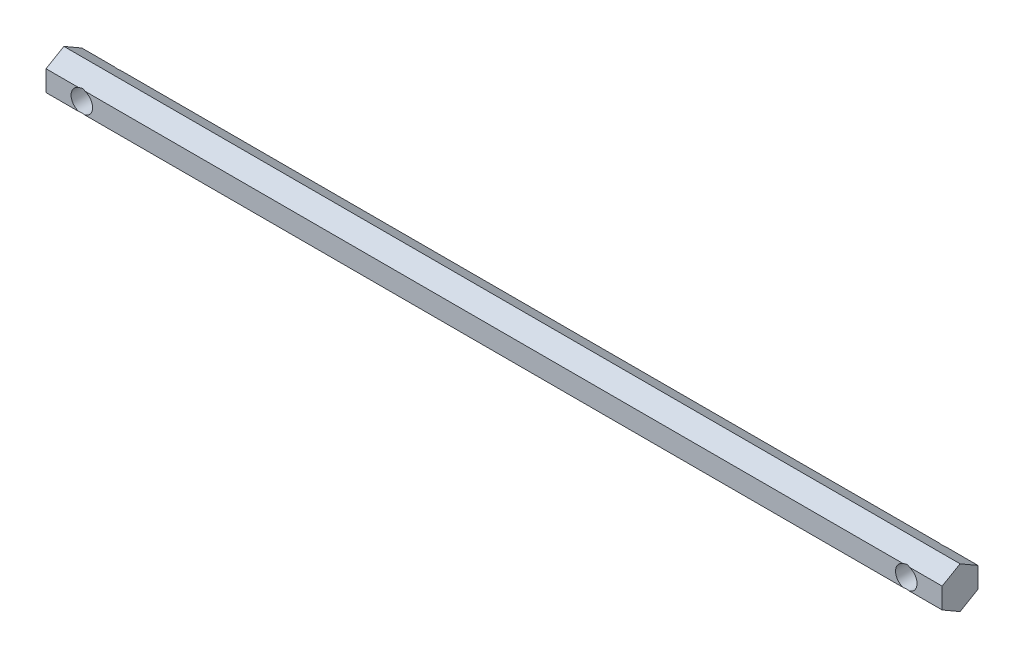
ISO-10303-21;
HEADER;
FILE_DESCRIPTION(('STEP AP214'),'2;1');
FILE_NAME('part.step','',(''),(''),'','','');
FILE_SCHEMA(('AUTOMOTIVE_DESIGN { 1 0 10303 214 1 1 1 1 }'));
ENDSEC;
DATA;
#1=APPLICATION_CONTEXT('core data for automotive mechanical design processes');
#2=APPLICATION_PROTOCOL_DEFINITION('international standard','automotive_design',2000,#1);
#3=PRODUCT_CONTEXT('',#1,'mechanical');
#4=PRODUCT('Part','Part','',(#3));
#5=PRODUCT_RELATED_PRODUCT_CATEGORY('part','',(#4));
#6=PRODUCT_DEFINITION_FORMATION('','',#4);
#7=PRODUCT_DEFINITION_CONTEXT('part definition',#1,'design');
#8=PRODUCT_DEFINITION('design','',#6,#7);
#9=PRODUCT_DEFINITION_SHAPE('','',#8);
#10=(LENGTH_UNIT() NAMED_UNIT(*) SI_UNIT(.MILLI.,.METRE.));
#11=(NAMED_UNIT(*) PLANE_ANGLE_UNIT() SI_UNIT($,.RADIAN.));
#12=(NAMED_UNIT(*) SI_UNIT($,.STERADIAN.) SOLID_ANGLE_UNIT());
#13=UNCERTAINTY_MEASURE_WITH_UNIT(LENGTH_MEASURE(1.E-05),#10,'distance_accuracy_value','');
#14=(GEOMETRIC_REPRESENTATION_CONTEXT(3) GLOBAL_UNCERTAINTY_ASSIGNED_CONTEXT((#13)) GLOBAL_UNIT_ASSIGNED_CONTEXT((#10,
#11,#12)) REPRESENTATION_CONTEXT('',''));
#15=CARTESIAN_POINT('',(0.,0.,0.));
#16=DIRECTION('',(0.,0.,1.));
#17=DIRECTION('',(1.,0.,0.));
#18=AXIS2_PLACEMENT_3D('',#15,#16,#17);
#19=CARTESIAN_POINT('',(125.,2.88675134594811,5.));
#20=DIRECTION('',(0.,0.,-1.));
#21=DIRECTION('',(0.,1.,0.));
#22=AXIS2_PLACEMENT_3D('',#19,#20,#21);
#23=PLANE('',#22);
#24=DIRECTION('',(-1.,0.,0.));
#25=VECTOR('',#24,1.);
#26=CARTESIAN_POINT('',(125.,2.88675134594811,5.));
#27=LINE('',#26,#25);
#28=CARTESIAN_POINT('',(114.183503419072,2.88675134594811,5.));
#29=VERTEX_POINT('',#28);
#30=CARTESIAN_POINT('',(-114.183503419072,2.88675134594811,5.));
#31=VERTEX_POINT('',#30);
#32=EDGE_CURVE('E263',#29,#31,#27,.T.);
#33=ORIENTED_EDGE('',*,*,#32,.T.);
#34=CARTESIAN_POINT('',(-115.,0.,5.));
#35=DIRECTION('',(0.,0.,1.));
#36=DIRECTION('',(1.,0.,0.));
#37=AXIS2_PLACEMENT_3D('',#34,#35,#36);
#38=CIRCLE('',#37,3.00000000000001);
#39=CARTESIAN_POINT('',(-114.183503419072,-2.88675134594814,5.));
#40=VERTEX_POINT('',#39);
#41=EDGE_CURVE('E320',#40,#31,#38,.T.);
#42=ORIENTED_EDGE('',*,*,#41,.F.);
#43=DIRECTION('',(-1.,0.,0.));
#44=VECTOR('',#43,1.);
#45=CARTESIAN_POINT('',(125.,-2.88675134594815,4.99999999999998));
#46=LINE('',#45,#44);
#47=CARTESIAN_POINT('',(114.183503419072,-2.88675134594815,4.99999999999998));
#48=VERTEX_POINT('',#47);
#49=EDGE_CURVE('E257',#48,#40,#46,.T.);
#50=ORIENTED_EDGE('',*,*,#49,.F.);
#51=CARTESIAN_POINT('',(115.,0.,5.));
#52=DIRECTION('',(0.,0.,1.));
#53=DIRECTION('',(1.,0.,0.));
#54=AXIS2_PLACEMENT_3D('',#51,#52,#53);
#55=CIRCLE('',#54,3.00000000000001);
#56=EDGE_CURVE('E63',#29,#48,#55,.T.);
#57=ORIENTED_EDGE('',*,*,#56,.F.);
#58=EDGE_LOOP('',(#33,#42,#50,#57));
#59=FACE_BOUND('',#58,.T.);
#60=ADVANCED_FACE('F39',(#59),#23,.F.);
#61=CARTESIAN_POINT('',(125.,2.88675134594811,5.));
#62=VERTEX_POINT('',#61);
#63=CARTESIAN_POINT('',(115.816496580928,2.88675134594811,5.));
#64=VERTEX_POINT('',#63);
#65=EDGE_CURVE('E258',#62,#64,#27,.T.);
#66=ORIENTED_EDGE('',*,*,#65,.T.);
#67=CARTESIAN_POINT('',(115.816496580928,-2.88675134594814,5.));
#68=VERTEX_POINT('',#67);
#69=EDGE_CURVE('E325',#68,#64,#55,.T.);
#70=ORIENTED_EDGE('',*,*,#69,.F.);
#71=CARTESIAN_POINT('',(125.,-2.88675134594815,4.99999999999998));
#72=VERTEX_POINT('',#71);
#73=EDGE_CURVE('E253',#72,#68,#46,.T.);
#74=ORIENTED_EDGE('',*,*,#73,.F.);
#75=DIRECTION('',(0.,-1.,0.));
#76=VECTOR('',#75,1.);
#77=CARTESIAN_POINT('',(125.,2.88675134594811,5.));
#78=LINE('',#77,#76);
#79=EDGE_CURVE('E220',#62,#72,#78,.T.);
#80=ORIENTED_EDGE('',*,*,#79,.F.);
#81=EDGE_LOOP('',(#66,#70,#74,#80));
#82=FACE_BOUND('',#81,.T.);
#83=ADVANCED_FACE('F297',(#82),#23,.F.);
#84=CARTESIAN_POINT('',(125.,-2.88675134594808,-5.00000000000002));
#85=DIRECTION('',(0.,0.,1.));
#86=DIRECTION('',(0.,-1.,0.));
#87=AXIS2_PLACEMENT_3D('',#84,#85,#86);
#88=PLANE('',#87);
#89=DIRECTION('',(-1.,0.,0.));
#90=VECTOR('',#89,1.);
#91=CARTESIAN_POINT('',(125.,-2.88675134594808,-5.00000000000002));
#92=LINE('',#91,#90);
#93=CARTESIAN_POINT('',(114.183503419072,-2.88675134594808,-5.00000000000002));
#94=VERTEX_POINT('',#93);
#95=CARTESIAN_POINT('',(-114.183503419072,-2.88675134594808,-5.00000000000002));
#96=VERTEX_POINT('',#95);
#97=EDGE_CURVE('E175',#94,#96,#92,.T.);
#98=ORIENTED_EDGE('',*,*,#97,.T.);
#99=CARTESIAN_POINT('',(-115.,0.,-4.99999999999999));
#100=DIRECTION('',(0.,0.,1.));
#101=DIRECTION('',(0.,-1.,0.));
#102=AXIS2_PLACEMENT_3D('',#99,#100,#101);
#103=CIRCLE('',#102,3.00000000000001);
#104=CARTESIAN_POINT('',(-114.183503419072,2.88675134594818,-5.00000000000002));
#105=VERTEX_POINT('',#104);
#106=EDGE_CURVE('E11',#96,#105,#103,.T.);
#107=ORIENTED_EDGE('',*,*,#106,.T.);
#108=DIRECTION('',(-1.,0.,0.));
#109=VECTOR('',#108,1.);
#110=CARTESIAN_POINT('',(125.,2.88675134594818,-4.99999999999996));
#111=LINE('',#110,#109);
#112=CARTESIAN_POINT('',(114.183503419072,2.88675134594818,-5.00000000000002));
#113=VERTEX_POINT('',#112);
#114=EDGE_CURVE('E170',#113,#105,#111,.T.);
#115=ORIENTED_EDGE('',*,*,#114,.F.);
#116=CARTESIAN_POINT('',(115.,0.,-4.99999999999999));
#117=DIRECTION('',(0.,0.,1.));
#118=DIRECTION('',(0.,-1.,0.));
#119=AXIS2_PLACEMENT_3D('',#116,#117,#118);
#120=CIRCLE('',#119,3.00000000000001);
#121=EDGE_CURVE('E146',#113,#94,#120,.T.);
#122=ORIENTED_EDGE('',*,*,#121,.T.);
#123=EDGE_LOOP('',(#98,#107,#115,#122));
#124=FACE_BOUND('',#123,.T.);
#125=ADVANCED_FACE('F268',(#124),#88,.F.);
#126=CARTESIAN_POINT('',(125.,-2.88675134594808,-5.00000000000002));
#127=VERTEX_POINT('',#126);
#128=CARTESIAN_POINT('',(115.816496580928,-2.88675134594808,-5.00000000000002));
#129=VERTEX_POINT('',#128);
#130=EDGE_CURVE('E163',#127,#129,#92,.T.);
#131=ORIENTED_EDGE('',*,*,#130,.T.);
#132=CARTESIAN_POINT('',(115.816496580928,2.88675134594818,-5.00000000000002));
#133=VERTEX_POINT('',#132);
#134=EDGE_CURVE('E143',#129,#133,#120,.T.);
#135=ORIENTED_EDGE('',*,*,#134,.T.);
#136=CARTESIAN_POINT('',(125.,2.88675134594818,-4.99999999999996));
#137=VERTEX_POINT('',#136);
#138=EDGE_CURVE('E160',#137,#133,#111,.T.);
#139=ORIENTED_EDGE('',*,*,#138,.F.);
#140=DIRECTION('',(0.,1.,0.));
#141=VECTOR('',#140,1.);
#142=CARTESIAN_POINT('',(125.,-2.88675134594808,-5.00000000000002));
#143=LINE('',#142,#141);
#144=EDGE_CURVE('E179',#127,#137,#143,.T.);
#145=ORIENTED_EDGE('',*,*,#144,.F.);
#146=EDGE_LOOP('',(#131,#135,#139,#145));
#147=FACE_BOUND('',#146,.T.);
#148=ADVANCED_FACE('F158',(#147),#88,.F.);
#149=CARTESIAN_POINT('',(125.,2.88675134594818,-4.99999999999996));
#150=DIRECTION('',(0.,-0.866025403784442,0.499999999999995));
#151=DIRECTION('',(0.,-0.499999999999995,-0.866025403784441));
#152=AXIS2_PLACEMENT_3D('',#149,#150,#151);
#153=PLANE('',#152);
#154=ORIENTED_EDGE('',*,*,#114,.T.);
#155=CARTESIAN_POINT('',(-115.,0.,-10.0000000000001));
#156=DIRECTION('',(0.,-0.866025403784442,0.499999999999995));
#157=DIRECTION('',(0.,0.499999999999995,0.866025403784441));
#158=AXIS2_PLACEMENT_3D('',#155,#156,#157);
#159=ELLIPSE('',#158,6.00000000000008,3.00000000000001);
#160=CARTESIAN_POINT('',(-115.816496580928,2.88675134594818,-5.00000000000002));
#161=VERTEX_POINT('',#160);
#162=EDGE_CURVE('E197',#105,#161,#159,.T.);
#163=ORIENTED_EDGE('',*,*,#162,.T.);
#164=CARTESIAN_POINT('',(-125.,2.88675134594818,-4.99999999999996));
#165=VERTEX_POINT('',#164);
#166=EDGE_CURVE('E172',#161,#165,#111,.T.);
#167=ORIENTED_EDGE('',*,*,#166,.T.);
#168=DIRECTION('',(0.,0.499999999999995,0.866025403784441));
#169=VECTOR('',#168,1.);
#170=CARTESIAN_POINT('',(-125.,2.88675134594818,-4.99999999999996));
#171=LINE('',#170,#169);
#172=CARTESIAN_POINT('',(-125.,5.77350269189625,0.));
#173=VERTEX_POINT('',#172);
#174=EDGE_CURVE('E193',#165,#173,#171,.T.);
#175=ORIENTED_EDGE('',*,*,#174,.T.);
#176=DIRECTION('',(-1.,0.,0.));
#177=VECTOR('',#176,1.);
#178=CARTESIAN_POINT('',(125.,5.77350269189625,0.));
#179=LINE('',#178,#177);
#180=CARTESIAN_POINT('',(125.,5.77350269189625,0.));
#181=VERTEX_POINT('',#180);
#182=EDGE_CURVE('E262',#181,#173,#179,.T.);
#183=ORIENTED_EDGE('',*,*,#182,.F.);
#184=DIRECTION('',(0.,0.499999999999995,0.866025403784441));
#185=VECTOR('',#184,1.);
#186=CARTESIAN_POINT('',(125.,2.88675134594818,-4.99999999999996));
#187=LINE('',#186,#185);
#188=EDGE_CURVE('E167',#137,#181,#187,.T.);
#189=ORIENTED_EDGE('',*,*,#188,.F.);
#190=ORIENTED_EDGE('',*,*,#138,.T.);
#191=CARTESIAN_POINT('',(115.,0.,-10.0000000000001));
#192=DIRECTION('',(0.,-0.866025403784442,0.499999999999995));
#193=DIRECTION('',(0.,0.499999999999995,0.866025403784441));
#194=AXIS2_PLACEMENT_3D('',#191,#192,#193);
#195=ELLIPSE('',#194,6.00000000000008,3.00000000000001);
#196=EDGE_CURVE('E140',#133,#113,#195,.T.);
#197=ORIENTED_EDGE('',*,*,#196,.T.);
#198=EDGE_LOOP('',(#154,#163,#167,#175,#183,#189,#190,#197));
#199=FACE_BOUND('',#198,.T.);
#200=ADVANCED_FACE('F41',(#199),#153,.F.);
#201=CARTESIAN_POINT('',(125.,5.77350269189625,0.));
#202=DIRECTION('',(0.,-0.866025403784438,-0.500000000000001));
#203=DIRECTION('',(0.,0.500000000000001,-0.866025403784438));
#204=AXIS2_PLACEMENT_3D('',#201,#202,#203);
#205=PLANE('',#204);
#206=CARTESIAN_POINT('',(-115.816496580928,2.88675134594811,5.));
#207=VERTEX_POINT('',#206);
#208=CARTESIAN_POINT('',(-125.,2.88675134594811,5.));
#209=VERTEX_POINT('',#208);
#210=EDGE_CURVE('E256',#207,#209,#27,.T.);
#211=ORIENTED_EDGE('',*,*,#210,.F.);
#212=CARTESIAN_POINT('',(-115.,0.,9.99999999999996));
#213=DIRECTION('',(0.,-0.866025403784438,-0.500000000000001));
#214=DIRECTION('',(0.,-0.500000000000001,0.866025403784438));
#215=AXIS2_PLACEMENT_3D('',#212,#213,#214);
#216=ELLIPSE('',#215,6.,3.00000000000001);
#217=EDGE_CURVE('E276',#207,#31,#216,.T.);
#218=ORIENTED_EDGE('',*,*,#217,.T.);
#219=ORIENTED_EDGE('',*,*,#32,.F.);
#220=CARTESIAN_POINT('',(115.,0.,9.99999999999996));
#221=DIRECTION('',(0.,-0.866025403784438,-0.500000000000001));
#222=DIRECTION('',(0.,-0.500000000000001,0.866025403784438));
#223=AXIS2_PLACEMENT_3D('',#220,#221,#222);
#224=ELLIPSE('',#223,6.,3.00000000000001);
#225=EDGE_CURVE('E153',#29,#64,#224,.T.);
#226=ORIENTED_EDGE('',*,*,#225,.T.);
#227=ORIENTED_EDGE('',*,*,#65,.F.);
#228=DIRECTION('',(0.,-0.500000000000001,0.866025403784438));
#229=VECTOR('',#228,1.);
#230=CARTESIAN_POINT('',(125.,5.77350269189625,0.));
#231=LINE('',#230,#229);
#232=EDGE_CURVE('E217',#181,#62,#231,.T.);
#233=ORIENTED_EDGE('',*,*,#232,.F.);
#234=ORIENTED_EDGE('',*,*,#182,.T.);
#235=DIRECTION('',(0.,-0.500000000000001,0.866025403784438));
#236=VECTOR('',#235,1.);
#237=CARTESIAN_POINT('',(-125.,5.77350269189625,0.));
#238=LINE('',#237,#236);
#239=EDGE_CURVE('E196',#173,#209,#238,.T.);
#240=ORIENTED_EDGE('',*,*,#239,.T.);
#241=EDGE_LOOP('',(#211,#218,#219,#226,#227,#233,#234,#240));
#242=FACE_BOUND('',#241,.T.);
#243=ADVANCED_FACE('F307',(#242),#205,.F.);
#244=CARTESIAN_POINT('',(-115.816496580928,-2.88675134594815,4.99999999999998));
#245=VERTEX_POINT('',#244);
#246=CARTESIAN_POINT('',(-125.,-2.88675134594815,4.99999999999998));
#247=VERTEX_POINT('',#246);
#248=EDGE_CURVE('E243',#245,#247,#46,.T.);
#249=ORIENTED_EDGE('',*,*,#248,.F.);
#250=EDGE_CURVE('E55',#207,#245,#38,.T.);
#251=ORIENTED_EDGE('',*,*,#250,.F.);
#252=ORIENTED_EDGE('',*,*,#210,.T.);
#253=DIRECTION('',(0.,-1.,0.));
#254=VECTOR('',#253,1.);
#255=CARTESIAN_POINT('',(-125.,2.88675134594811,5.));
#256=LINE('',#255,#254);
#257=EDGE_CURVE('E201',#209,#247,#256,.T.);
#258=ORIENTED_EDGE('',*,*,#257,.T.);
#259=EDGE_LOOP('',(#249,#251,#252,#258));
#260=FACE_BOUND('',#259,.T.);
#261=ADVANCED_FACE('F300',(#260),#23,.F.);
#262=CARTESIAN_POINT('',(125.,-2.88675134594815,4.99999999999998));
#263=DIRECTION('',(0.,0.866025403784442,-0.499999999999995));
#264=DIRECTION('',(0.,0.499999999999995,0.866025403784441));
#265=AXIS2_PLACEMENT_3D('',#262,#263,#264);
#266=PLANE('',#265);
#267=ORIENTED_EDGE('',*,*,#49,.T.);
#268=CARTESIAN_POINT('',(-115.,0.,10.0000000000001));
#269=DIRECTION('',(0.,0.866025403784442,-0.499999999999995));
#270=DIRECTION('',(0.,0.499999999999995,0.866025403784441));
#271=AXIS2_PLACEMENT_3D('',#268,#269,#270);
#272=ELLIPSE('',#271,6.00000000000007,3.00000000000001);
#273=EDGE_CURVE('E273',#40,#245,#272,.T.);
#274=ORIENTED_EDGE('',*,*,#273,.T.);
#275=ORIENTED_EDGE('',*,*,#248,.T.);
#276=DIRECTION('',(0.,-0.499999999999995,-0.866025403784441));
#277=VECTOR('',#276,1.);
#278=CARTESIAN_POINT('',(-125.,-2.88675134594815,4.99999999999998));
#279=LINE('',#278,#277);
#280=CARTESIAN_POINT('',(-125.,-5.77350269189625,0.));
#281=VERTEX_POINT('',#280);
#282=EDGE_CURVE('E205',#247,#281,#279,.T.);
#283=ORIENTED_EDGE('',*,*,#282,.T.);
#284=DIRECTION('',(-1.,0.,0.));
#285=VECTOR('',#284,1.);
#286=CARTESIAN_POINT('',(125.,-5.77350269189625,0.));
#287=LINE('',#286,#285);
#288=CARTESIAN_POINT('',(125.,-5.77350269189625,0.));
#289=VERTEX_POINT('',#288);
#290=EDGE_CURVE('E236',#289,#281,#287,.T.);
#291=ORIENTED_EDGE('',*,*,#290,.F.);
#292=DIRECTION('',(0.,-0.499999999999995,-0.866025403784441));
#293=VECTOR('',#292,1.);
#294=CARTESIAN_POINT('',(125.,-2.88675134594815,4.99999999999998));
#295=LINE('',#294,#293);
#296=EDGE_CURVE('E189',#72,#289,#295,.T.);
#297=ORIENTED_EDGE('',*,*,#296,.F.);
#298=ORIENTED_EDGE('',*,*,#73,.T.);
#299=CARTESIAN_POINT('',(115.,0.,10.0000000000001));
#300=DIRECTION('',(0.,0.866025403784442,-0.499999999999995));
#301=DIRECTION('',(0.,0.499999999999995,0.866025403784441));
#302=AXIS2_PLACEMENT_3D('',#299,#300,#301);
#303=ELLIPSE('',#302,6.00000000000007,3.00000000000001);
#304=EDGE_CURVE('E318',#68,#48,#303,.T.);
#305=ORIENTED_EDGE('',*,*,#304,.T.);
#306=EDGE_LOOP('',(#267,#274,#275,#283,#291,#297,#298,#305));
#307=FACE_BOUND('',#306,.T.);
#308=ADVANCED_FACE('F238',(#307),#266,.F.);
#309=CARTESIAN_POINT('',(125.,-5.77350269189625,0.));
#310=DIRECTION('',(0.,0.866025403784435,0.500000000000007));
#311=DIRECTION('',(0.,-0.500000000000007,0.866025403784435));
#312=AXIS2_PLACEMENT_3D('',#309,#310,#311);
#313=PLANE('',#312);
#314=CARTESIAN_POINT('',(-115.816496580928,-2.88675134594808,-5.00000000000002));
#315=VERTEX_POINT('',#314);
#316=CARTESIAN_POINT('',(-125.,-2.88675134594808,-5.00000000000002));
#317=VERTEX_POINT('',#316);
#318=EDGE_CURVE('E169',#315,#317,#92,.T.);
#319=ORIENTED_EDGE('',*,*,#318,.F.);
#320=CARTESIAN_POINT('',(-115.,0.,-9.99999999999983));
#321=DIRECTION('',(0.,0.866025403784435,0.500000000000007));
#322=DIRECTION('',(0.,-0.500000000000007,0.866025403784435));
#323=AXIS2_PLACEMENT_3D('',#320,#321,#322);
#324=ELLIPSE('',#323,5.99999999999993,3.00000000000001);
#325=EDGE_CURVE('E152',#315,#96,#324,.T.);
#326=ORIENTED_EDGE('',*,*,#325,.T.);
#327=ORIENTED_EDGE('',*,*,#97,.F.);
#328=CARTESIAN_POINT('',(115.,0.,-9.99999999999983));
#329=DIRECTION('',(0.,0.866025403784435,0.500000000000007));
#330=DIRECTION('',(0.,-0.500000000000007,0.866025403784435));
#331=AXIS2_PLACEMENT_3D('',#328,#329,#330);
#332=ELLIPSE('',#331,5.99999999999993,3.00000000000001);
#333=EDGE_CURVE('E248',#94,#129,#332,.T.);
#334=ORIENTED_EDGE('',*,*,#333,.T.);
#335=ORIENTED_EDGE('',*,*,#130,.F.);
#336=DIRECTION('',(0.,0.500000000000007,-0.866025403784435));
#337=VECTOR('',#336,1.);
#338=CARTESIAN_POINT('',(125.,-5.77350269189625,0.));
#339=LINE('',#338,#337);
#340=EDGE_CURVE('E185',#289,#127,#339,.T.);
#341=ORIENTED_EDGE('',*,*,#340,.F.);
#342=ORIENTED_EDGE('',*,*,#290,.T.);
#343=DIRECTION('',(0.,0.500000000000007,-0.866025403784435));
#344=VECTOR('',#343,1.);
#345=CARTESIAN_POINT('',(-125.,-5.77350269189625,0.));
#346=LINE('',#345,#344);
#347=EDGE_CURVE('E208',#281,#317,#346,.T.);
#348=ORIENTED_EDGE('',*,*,#347,.T.);
#349=EDGE_LOOP('',(#319,#326,#327,#334,#335,#341,#342,#348));
#350=FACE_BOUND('',#349,.T.);
#351=ADVANCED_FACE('F246',(#350),#313,.F.);
#352=ORIENTED_EDGE('',*,*,#166,.F.);
#353=EDGE_CURVE('E43',#161,#315,#103,.T.);
#354=ORIENTED_EDGE('',*,*,#353,.T.);
#355=ORIENTED_EDGE('',*,*,#318,.T.);
#356=DIRECTION('',(0.,1.,0.));
#357=VECTOR('',#356,1.);
#358=CARTESIAN_POINT('',(-125.,-2.88675134594808,-5.00000000000002));
#359=LINE('',#358,#357);
#360=EDGE_CURVE('E211',#317,#165,#359,.T.);
#361=ORIENTED_EDGE('',*,*,#360,.T.);
#362=EDGE_LOOP('',(#352,#354,#355,#361));
#363=FACE_BOUND('',#362,.T.);
#364=ADVANCED_FACE('F286',(#363),#88,.F.);
#365=CARTESIAN_POINT('',(125.,0.,0.));
#366=DIRECTION('',(1.,0.,0.));
#367=DIRECTION('',(0.,0.,-1.));
#368=AXIS2_PLACEMENT_3D('',#365,#366,#367);
#369=PLANE('',#368);
#370=ORIENTED_EDGE('',*,*,#188,.T.);
#371=ORIENTED_EDGE('',*,*,#232,.T.);
#372=ORIENTED_EDGE('',*,*,#79,.T.);
#373=ORIENTED_EDGE('',*,*,#296,.T.);
#374=ORIENTED_EDGE('',*,*,#340,.T.);
#375=ORIENTED_EDGE('',*,*,#144,.T.);
#376=EDGE_LOOP('',(#370,#371,#372,#373,#374,#375));
#377=FACE_BOUND('',#376,.T.);
#378=ADVANCED_FACE('F229',(#377),#369,.T.);
#379=CARTESIAN_POINT('',(-125.,0.,0.));
#380=DIRECTION('',(1.,0.,0.));
#381=DIRECTION('',(0.,0.,-1.));
#382=AXIS2_PLACEMENT_3D('',#379,#380,#381);
#383=PLANE('',#382);
#384=ORIENTED_EDGE('',*,*,#174,.F.);
#385=ORIENTED_EDGE('',*,*,#360,.F.);
#386=ORIENTED_EDGE('',*,*,#347,.F.);
#387=ORIENTED_EDGE('',*,*,#282,.F.);
#388=ORIENTED_EDGE('',*,*,#257,.F.);
#389=ORIENTED_EDGE('',*,*,#239,.F.);
#390=EDGE_LOOP('',(#384,#385,#386,#387,#388,#389));
#391=FACE_BOUND('',#390,.T.);
#392=ADVANCED_FACE('F294',(#391),#383,.F.);
#393=CARTESIAN_POINT('',(115.,0.,-5.00000000000002));
#394=DIRECTION('',(0.,0.,1.));
#395=DIRECTION('',(1.,0.,0.));
#396=AXIS2_PLACEMENT_3D('',#393,#394,#395);
#397=CYLINDRICAL_SURFACE('',#396,3.00000000000001);
#398=ORIENTED_EDGE('',*,*,#56,.T.);
#399=ORIENTED_EDGE('',*,*,#304,.F.);
#400=ORIENTED_EDGE('',*,*,#69,.T.);
#401=ORIENTED_EDGE('',*,*,#225,.F.);
#402=EDGE_LOOP('',(#398,#399,#400,#401));
#403=FACE_BOUND('',#402,.T.);
#404=ORIENTED_EDGE('',*,*,#134,.F.);
#405=ORIENTED_EDGE('',*,*,#333,.F.);
#406=ORIENTED_EDGE('',*,*,#121,.F.);
#407=ORIENTED_EDGE('',*,*,#196,.F.);
#408=EDGE_LOOP('',(#404,#405,#406,#407));
#409=FACE_BOUND('',#408,.T.);
#410=ADVANCED_FACE('F142',(#403,#409),#397,.F.);
#411=CARTESIAN_POINT('',(-115.,0.,-5.00000000000002));
#412=DIRECTION('',(0.,0.,1.));
#413=DIRECTION('',(1.,0.,0.));
#414=AXIS2_PLACEMENT_3D('',#411,#412,#413);
#415=CYLINDRICAL_SURFACE('',#414,3.00000000000001);
#416=ORIENTED_EDGE('',*,*,#250,.T.);
#417=ORIENTED_EDGE('',*,*,#273,.F.);
#418=ORIENTED_EDGE('',*,*,#41,.T.);
#419=ORIENTED_EDGE('',*,*,#217,.F.);
#420=EDGE_LOOP('',(#416,#417,#418,#419));
#421=FACE_BOUND('',#420,.T.);
#422=ORIENTED_EDGE('',*,*,#106,.F.);
#423=ORIENTED_EDGE('',*,*,#325,.F.);
#424=ORIENTED_EDGE('',*,*,#353,.F.);
#425=ORIENTED_EDGE('',*,*,#162,.F.);
#426=EDGE_LOOP('',(#422,#423,#424,#425));
#427=FACE_BOUND('',#426,.T.);
#428=ADVANCED_FACE('F288',(#421,#427),#415,.F.);
#429=CLOSED_SHELL('',(#60,#83,#125,#148,#200,#243,#261,#308,#351,#364,#378,#392,#410,#428));
#430=MANIFOLD_SOLID_BREP('B2',#429);
#431=ADVANCED_BREP_SHAPE_REPRESENTATION('',(#18,#430),#14);
#432=SHAPE_DEFINITION_REPRESENTATION(#9,#431);
ENDSEC;
END-ISO-10303-21;
